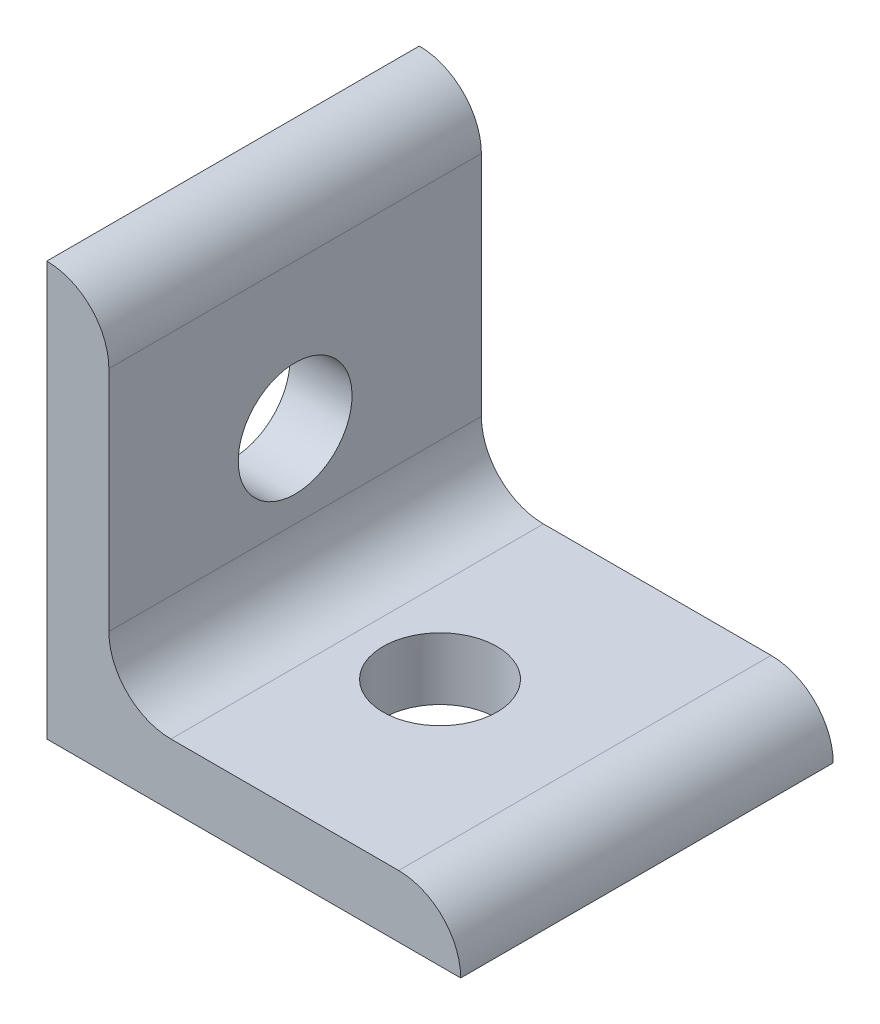
ISO-10303-21;
HEADER;
FILE_DESCRIPTION(('STEP AP214'),'2;1');
FILE_NAME('part.step','',(''),(''),'','','');
FILE_SCHEMA(('AUTOMOTIVE_DESIGN { 1 0 10303 214 1 1 1 1 }'));
ENDSEC;
DATA;
#1=APPLICATION_CONTEXT('core data for automotive mechanical design processes');
#2=APPLICATION_PROTOCOL_DEFINITION('international standard','automotive_design',2000,#1);
#3=PRODUCT_CONTEXT('',#1,'mechanical');
#4=PRODUCT('Part','Part','',(#3));
#5=PRODUCT_RELATED_PRODUCT_CATEGORY('part','',(#4));
#6=PRODUCT_DEFINITION_FORMATION('','',#4);
#7=PRODUCT_DEFINITION_CONTEXT('part definition',#1,'design');
#8=PRODUCT_DEFINITION('design','',#6,#7);
#9=PRODUCT_DEFINITION_SHAPE('','',#8);
#10=(LENGTH_UNIT() NAMED_UNIT(*) SI_UNIT(.MILLI.,.METRE.));
#11=(NAMED_UNIT(*) PLANE_ANGLE_UNIT() SI_UNIT($,.RADIAN.));
#12=(NAMED_UNIT(*) SI_UNIT($,.STERADIAN.) SOLID_ANGLE_UNIT());
#13=UNCERTAINTY_MEASURE_WITH_UNIT(LENGTH_MEASURE(1.E-05),#10,'distance_accuracy_value','');
#14=(GEOMETRIC_REPRESENTATION_CONTEXT(3) GLOBAL_UNCERTAINTY_ASSIGNED_CONTEXT((#13)) GLOBAL_UNIT_ASSIGNED_CONTEXT((#10,
#11,#12)) REPRESENTATION_CONTEXT('',''));
#15=CARTESIAN_POINT('',(0.,0.,0.));
#16=DIRECTION('',(0.,0.,1.));
#17=DIRECTION('',(1.,0.,0.));
#18=AXIS2_PLACEMENT_3D('',#15,#16,#17);
#19=CARTESIAN_POINT('',(3.,17.,9.));
#20=DIRECTION('',(-1.,0.,0.));
#21=DIRECTION('',(0.,-1.,0.));
#22=AXIS2_PLACEMENT_3D('',#19,#20,#21);
#23=PLANE('',#22);
#24=DIRECTION('',(0.,1.,0.));
#25=VECTOR('',#24,1.);
#26=CARTESIAN_POINT('',(3.,17.,-9.));
#27=LINE('',#26,#25);
#28=CARTESIAN_POINT('',(3.,6.,-9.));
#29=VERTEX_POINT('',#28);
#30=CARTESIAN_POINT('',(3.,17.,-9.));
#31=VERTEX_POINT('',#30);
#32=EDGE_CURVE('E114',#29,#31,#27,.T.);
#33=ORIENTED_EDGE('',*,*,#32,.T.);
#34=DIRECTION('',(0.,0.,-1.));
#35=VECTOR('',#34,1.);
#36=CARTESIAN_POINT('',(3.,17.,9.));
#37=LINE('',#36,#35);
#38=CARTESIAN_POINT('',(3.,17.,9.));
#39=VERTEX_POINT('',#38);
#40=EDGE_CURVE('E111',#39,#31,#37,.T.);
#41=ORIENTED_EDGE('',*,*,#40,.F.);
#42=DIRECTION('',(0.,1.,0.));
#43=VECTOR('',#42,1.);
#44=CARTESIAN_POINT('',(3.,17.,9.));
#45=LINE('',#44,#43);
#46=CARTESIAN_POINT('',(3.,6.,9.));
#47=VERTEX_POINT('',#46);
#48=EDGE_CURVE('E100',#47,#39,#45,.T.);
#49=ORIENTED_EDGE('',*,*,#48,.F.);
#50=DIRECTION('',(0.,0.,-1.));
#51=VECTOR('',#50,1.);
#52=CARTESIAN_POINT('',(3.,6.,9.));
#53=LINE('',#52,#51);
#54=EDGE_CURVE('E115',#47,#29,#53,.T.);
#55=ORIENTED_EDGE('',*,*,#54,.T.);
#56=EDGE_LOOP('',(#33,#41,#49,#55));
#57=FACE_BOUND('',#56,.T.);
#58=CARTESIAN_POINT('',(3.,10.,0.));
#59=DIRECTION('',(-1.,0.,0.));
#60=DIRECTION('',(0.,-1.,0.));
#61=AXIS2_PLACEMENT_3D('',#58,#59,#60);
#62=CIRCLE('',#61,2.75);
#63=CARTESIAN_POINT('',(3.,7.25000000000001,0.));
#64=VERTEX_POINT('',#63);
#65=EDGE_CURVE('E164',#64,#64,#62,.F.);
#66=ORIENTED_EDGE('',*,*,#65,.F.);
#67=EDGE_LOOP('',(#66));
#68=FACE_BOUND('',#67,.T.);
#69=ADVANCED_FACE('F32',(#57,#68),#23,.F.);
#70=CARTESIAN_POINT('',(0.,0.,9.));
#71=DIRECTION('',(1.,0.,0.));
#72=DIRECTION('',(0.,0.,-1.));
#73=AXIS2_PLACEMENT_3D('',#70,#71,#72);
#74=PLANE('',#73);
#75=DIRECTION('',(0.,-1.,0.));
#76=VECTOR('',#75,1.);
#77=CARTESIAN_POINT('',(0.,0.,-9.));
#78=LINE('',#77,#76);
#79=CARTESIAN_POINT('',(0.,20.,-9.));
#80=VERTEX_POINT('',#79);
#81=CARTESIAN_POINT('',(0.,0.,-9.));
#82=VERTEX_POINT('',#81);
#83=EDGE_CURVE('E82',#80,#82,#78,.T.);
#84=ORIENTED_EDGE('',*,*,#83,.T.);
#85=DIRECTION('',(0.,0.,-1.));
#86=VECTOR('',#85,1.);
#87=CARTESIAN_POINT('',(0.,0.,9.));
#88=LINE('',#87,#86);
#89=CARTESIAN_POINT('',(0.,0.,9.));
#90=VERTEX_POINT('',#89);
#91=EDGE_CURVE('E120',#90,#82,#88,.T.);
#92=ORIENTED_EDGE('',*,*,#91,.F.);
#93=DIRECTION('',(0.,-1.,0.));
#94=VECTOR('',#93,1.);
#95=CARTESIAN_POINT('',(0.,0.,9.));
#96=LINE('',#95,#94);
#97=CARTESIAN_POINT('',(0.,20.,9.));
#98=VERTEX_POINT('',#97);
#99=EDGE_CURVE('E50',#98,#90,#96,.T.);
#100=ORIENTED_EDGE('',*,*,#99,.F.);
#101=DIRECTION('',(0.,0.,-1.));
#102=VECTOR('',#101,1.);
#103=CARTESIAN_POINT('',(0.,20.,9.));
#104=LINE('',#103,#102);
#105=EDGE_CURVE('E116',#98,#80,#104,.T.);
#106=ORIENTED_EDGE('',*,*,#105,.T.);
#107=EDGE_LOOP('',(#84,#92,#100,#106));
#108=FACE_BOUND('',#107,.T.);
#109=CARTESIAN_POINT('',(0.,10.,0.));
#110=DIRECTION('',(1.,0.,0.));
#111=DIRECTION('',(0.,0.,-1.));
#112=AXIS2_PLACEMENT_3D('',#109,#110,#111);
#113=CIRCLE('',#112,2.75);
#114=CARTESIAN_POINT('',(0.,10.,-2.75));
#115=VERTEX_POINT('',#114);
#116=EDGE_CURVE('E167',#115,#115,#113,.T.);
#117=ORIENTED_EDGE('',*,*,#116,.T.);
#118=EDGE_LOOP('',(#117));
#119=FACE_BOUND('',#118,.T.);
#120=ADVANCED_FACE('F171',(#108,#119),#74,.F.);
#121=CARTESIAN_POINT('',(20.,0.,9.));
#122=DIRECTION('',(0.,1.,0.));
#123=DIRECTION('',(-1.,0.,0.));
#124=AXIS2_PLACEMENT_3D('',#121,#122,#123);
#125=PLANE('',#124);
#126=DIRECTION('',(1.,0.,0.));
#127=VECTOR('',#126,1.);
#128=CARTESIAN_POINT('',(20.,0.,-9.));
#129=LINE('',#128,#127);
#130=CARTESIAN_POINT('',(20.,0.,-9.));
#131=VERTEX_POINT('',#130);
#132=EDGE_CURVE('E124',#82,#131,#129,.T.);
#133=ORIENTED_EDGE('',*,*,#132,.T.);
#134=DIRECTION('',(0.,0.,-1.));
#135=VECTOR('',#134,1.);
#136=CARTESIAN_POINT('',(20.,0.,9.));
#137=LINE('',#136,#135);
#138=CARTESIAN_POINT('',(20.,0.,9.));
#139=VERTEX_POINT('',#138);
#140=EDGE_CURVE('E11',#139,#131,#137,.T.);
#141=ORIENTED_EDGE('',*,*,#140,.F.);
#142=DIRECTION('',(1.,0.,0.));
#143=VECTOR('',#142,1.);
#144=CARTESIAN_POINT('',(20.,0.,9.));
#145=LINE('',#144,#143);
#146=EDGE_CURVE('E136',#90,#139,#145,.T.);
#147=ORIENTED_EDGE('',*,*,#146,.F.);
#148=ORIENTED_EDGE('',*,*,#91,.T.);
#149=EDGE_LOOP('',(#133,#141,#147,#148));
#150=FACE_BOUND('',#149,.T.);
#151=CARTESIAN_POINT('',(10.,0.,0.));
#152=DIRECTION('',(0.,1.,0.));
#153=DIRECTION('',(0.,0.,1.));
#154=AXIS2_PLACEMENT_3D('',#151,#152,#153);
#155=CIRCLE('',#154,2.75);
#156=CARTESIAN_POINT('',(10.,0.,2.75));
#157=VERTEX_POINT('',#156);
#158=EDGE_CURVE('E161',#157,#157,#155,.T.);
#159=ORIENTED_EDGE('',*,*,#158,.T.);
#160=EDGE_LOOP('',(#159));
#161=FACE_BOUND('',#160,.T.);
#162=ADVANCED_FACE('F34',(#150,#161),#125,.F.);
#163=CARTESIAN_POINT('',(6.,3.,9.));
#164=DIRECTION('',(0.,-1.,0.));
#165=DIRECTION('',(1.,0.,0.));
#166=AXIS2_PLACEMENT_3D('',#163,#164,#165);
#167=PLANE('',#166);
#168=DIRECTION('',(-1.,0.,0.));
#169=VECTOR('',#168,1.);
#170=CARTESIAN_POINT('',(6.,3.,-9.));
#171=LINE('',#170,#169);
#172=CARTESIAN_POINT('',(17.,3.,-9.));
#173=VERTEX_POINT('',#172);
#174=CARTESIAN_POINT('',(6.,3.,-9.));
#175=VERTEX_POINT('',#174);
#176=EDGE_CURVE('E129',#173,#175,#171,.T.);
#177=ORIENTED_EDGE('',*,*,#176,.T.);
#178=DIRECTION('',(0.,0.,-1.));
#179=VECTOR('',#178,1.);
#180=CARTESIAN_POINT('',(6.,3.,9.));
#181=LINE('',#180,#179);
#182=CARTESIAN_POINT('',(6.,3.,9.));
#183=VERTEX_POINT('',#182);
#184=EDGE_CURVE('E140',#183,#175,#181,.T.);
#185=ORIENTED_EDGE('',*,*,#184,.F.);
#186=DIRECTION('',(-1.,0.,0.));
#187=VECTOR('',#186,1.);
#188=CARTESIAN_POINT('',(6.,3.,9.));
#189=LINE('',#188,#187);
#190=CARTESIAN_POINT('',(17.,3.,9.));
#191=VERTEX_POINT('',#190);
#192=EDGE_CURVE('E150',#191,#183,#189,.T.);
#193=ORIENTED_EDGE('',*,*,#192,.F.);
#194=DIRECTION('',(0.,0.,-1.));
#195=VECTOR('',#194,1.);
#196=CARTESIAN_POINT('',(17.,3.,9.));
#197=LINE('',#196,#195);
#198=EDGE_CURVE('E42',#191,#173,#197,.T.);
#199=ORIENTED_EDGE('',*,*,#198,.T.);
#200=EDGE_LOOP('',(#177,#185,#193,#199));
#201=FACE_BOUND('',#200,.T.);
#202=CARTESIAN_POINT('',(10.,3.,0.));
#203=DIRECTION('',(0.,-1.,0.));
#204=DIRECTION('',(1.,0.,0.));
#205=AXIS2_PLACEMENT_3D('',#202,#203,#204);
#206=CIRCLE('',#205,2.75);
#207=CARTESIAN_POINT('',(12.75,3.,0.));
#208=VERTEX_POINT('',#207);
#209=EDGE_CURVE('E36',#208,#208,#206,.F.);
#210=ORIENTED_EDGE('',*,*,#209,.F.);
#211=EDGE_LOOP('',(#210));
#212=FACE_BOUND('',#211,.T.);
#213=ADVANCED_FACE('F147',(#201,#212),#167,.F.);
#214=CARTESIAN_POINT('',(17.,0.,9.));
#215=DIRECTION('',(0.,0.,-1.));
#216=DIRECTION('',(-1.,0.,0.));
#217=AXIS2_PLACEMENT_3D('',#214,#215,#216);
#218=CYLINDRICAL_SURFACE('',#217,3.);
#219=CARTESIAN_POINT('',(17.,0.,-9.));
#220=DIRECTION('',(0.,0.,1.));
#221=DIRECTION('',(1.,0.,0.));
#222=AXIS2_PLACEMENT_3D('',#219,#220,#221);
#223=CIRCLE('',#222,3.);
#224=EDGE_CURVE('E127',#131,#173,#223,.T.);
#225=ORIENTED_EDGE('',*,*,#224,.T.);
#226=ORIENTED_EDGE('',*,*,#198,.F.);
#227=CARTESIAN_POINT('',(17.,0.,9.));
#228=DIRECTION('',(0.,0.,1.));
#229=DIRECTION('',(1.,0.,0.));
#230=AXIS2_PLACEMENT_3D('',#227,#228,#229);
#231=CIRCLE('',#230,3.);
#232=EDGE_CURVE('E90',#139,#191,#231,.T.);
#233=ORIENTED_EDGE('',*,*,#232,.F.);
#234=ORIENTED_EDGE('',*,*,#140,.T.);
#235=EDGE_LOOP('',(#225,#226,#233,#234));
#236=FACE_BOUND('',#235,.T.);
#237=ADVANCED_FACE('F189',(#236),#218,.T.);
#238=CARTESIAN_POINT('',(6.,6.,9.));
#239=DIRECTION('',(0.,0.,-1.));
#240=DIRECTION('',(-1.,0.,0.));
#241=AXIS2_PLACEMENT_3D('',#238,#239,#240);
#242=CYLINDRICAL_SURFACE('',#241,3.);
#243=CARTESIAN_POINT('',(6.,6.,-9.));
#244=DIRECTION('',(0.,0.,-1.));
#245=DIRECTION('',(1.,0.,0.));
#246=AXIS2_PLACEMENT_3D('',#243,#244,#245);
#247=CIRCLE('',#246,3.);
#248=EDGE_CURVE('E131',#175,#29,#247,.T.);
#249=ORIENTED_EDGE('',*,*,#248,.T.);
#250=ORIENTED_EDGE('',*,*,#54,.F.);
#251=CARTESIAN_POINT('',(6.,6.,9.));
#252=DIRECTION('',(0.,0.,-1.));
#253=DIRECTION('',(1.,0.,0.));
#254=AXIS2_PLACEMENT_3D('',#251,#252,#253);
#255=CIRCLE('',#254,3.);
#256=EDGE_CURVE('E106',#183,#47,#255,.T.);
#257=ORIENTED_EDGE('',*,*,#256,.F.);
#258=ORIENTED_EDGE('',*,*,#184,.T.);
#259=EDGE_LOOP('',(#249,#250,#257,#258));
#260=FACE_BOUND('',#259,.T.);
#261=ADVANCED_FACE('F156',(#260),#242,.F.);
#262=CARTESIAN_POINT('',(0.,17.,9.));
#263=DIRECTION('',(0.,0.,-1.));
#264=DIRECTION('',(-1.,0.,0.));
#265=AXIS2_PLACEMENT_3D('',#262,#263,#264);
#266=CYLINDRICAL_SURFACE('',#265,3.);
#267=CARTESIAN_POINT('',(0.,17.,-9.));
#268=DIRECTION('',(0.,0.,1.));
#269=DIRECTION('',(1.,0.,0.));
#270=AXIS2_PLACEMENT_3D('',#267,#268,#269);
#271=CIRCLE('',#270,3.);
#272=EDGE_CURVE('E76',#31,#80,#271,.T.);
#273=ORIENTED_EDGE('',*,*,#272,.T.);
#274=ORIENTED_EDGE('',*,*,#105,.F.);
#275=CARTESIAN_POINT('',(0.,17.,9.));
#276=DIRECTION('',(0.,0.,1.));
#277=DIRECTION('',(1.,0.,0.));
#278=AXIS2_PLACEMENT_3D('',#275,#276,#277);
#279=CIRCLE('',#278,3.);
#280=EDGE_CURVE('E104',#39,#98,#279,.T.);
#281=ORIENTED_EDGE('',*,*,#280,.F.);
#282=ORIENTED_EDGE('',*,*,#40,.T.);
#283=EDGE_LOOP('',(#273,#274,#281,#282));
#284=FACE_BOUND('',#283,.T.);
#285=ADVANCED_FACE('F118',(#284),#266,.T.);
#286=CARTESIAN_POINT('',(0.,17.,9.));
#287=DIRECTION('',(0.,0.,1.));
#288=DIRECTION('',(1.,0.,0.));
#289=AXIS2_PLACEMENT_3D('',#286,#287,#288);
#290=PLANE('',#289);
#291=ORIENTED_EDGE('',*,*,#146,.T.);
#292=ORIENTED_EDGE('',*,*,#232,.T.);
#293=ORIENTED_EDGE('',*,*,#192,.T.);
#294=ORIENTED_EDGE('',*,*,#256,.T.);
#295=ORIENTED_EDGE('',*,*,#48,.T.);
#296=ORIENTED_EDGE('',*,*,#280,.T.);
#297=ORIENTED_EDGE('',*,*,#99,.T.);
#298=EDGE_LOOP('',(#291,#292,#293,#294,#295,#296,#297));
#299=FACE_BOUND('',#298,.T.);
#300=ADVANCED_FACE('F102',(#299),#290,.T.);
#301=CARTESIAN_POINT('',(0.,17.,-9.));
#302=DIRECTION('',(0.,0.,1.));
#303=DIRECTION('',(1.,0.,0.));
#304=AXIS2_PLACEMENT_3D('',#301,#302,#303);
#305=PLANE('',#304);
#306=ORIENTED_EDGE('',*,*,#132,.F.);
#307=ORIENTED_EDGE('',*,*,#83,.F.);
#308=ORIENTED_EDGE('',*,*,#272,.F.);
#309=ORIENTED_EDGE('',*,*,#32,.F.);
#310=ORIENTED_EDGE('',*,*,#248,.F.);
#311=ORIENTED_EDGE('',*,*,#176,.F.);
#312=ORIENTED_EDGE('',*,*,#224,.F.);
#313=EDGE_LOOP('',(#306,#307,#308,#309,#310,#311,#312));
#314=FACE_BOUND('',#313,.T.);
#315=ADVANCED_FACE('F154',(#314),#305,.F.);
#316=CARTESIAN_POINT('',(10.,20.,0.));
#317=DIRECTION('',(0.,-1.,0.));
#318=DIRECTION('',(0.,0.,-1.));
#319=AXIS2_PLACEMENT_3D('',#316,#317,#318);
#320=CYLINDRICAL_SURFACE('',#319,2.75);
#321=ORIENTED_EDGE('',*,*,#158,.F.);
#322=EDGE_LOOP('',(#321));
#323=FACE_BOUND('',#322,.T.);
#324=ORIENTED_EDGE('',*,*,#209,.T.);
#325=EDGE_LOOP('',(#324));
#326=FACE_BOUND('',#325,.T.);
#327=ADVANCED_FACE('F176',(#323,#326),#320,.F.);
#328=CARTESIAN_POINT('',(20.,10.,0.));
#329=DIRECTION('',(-1.,0.,0.));
#330=DIRECTION('',(0.,0.,1.));
#331=AXIS2_PLACEMENT_3D('',#328,#329,#330);
#332=CYLINDRICAL_SURFACE('',#331,2.75);
#333=ORIENTED_EDGE('',*,*,#116,.F.);
#334=EDGE_LOOP('',(#333));
#335=FACE_BOUND('',#334,.T.);
#336=ORIENTED_EDGE('',*,*,#65,.T.);
#337=EDGE_LOOP('',(#336));
#338=FACE_BOUND('',#337,.T.);
#339=ADVANCED_FACE('F173',(#335,#338),#332,.F.);
#340=CLOSED_SHELL('',(#69,#120,#162,#213,#237,#261,#285,#300,#315,#327,#339));
#341=MANIFOLD_SOLID_BREP('B2',#340);
#342=ADVANCED_BREP_SHAPE_REPRESENTATION('',(#18,#341),#14);
#343=SHAPE_DEFINITION_REPRESENTATION(#9,#342);
ENDSEC;
END-ISO-10303-21;
